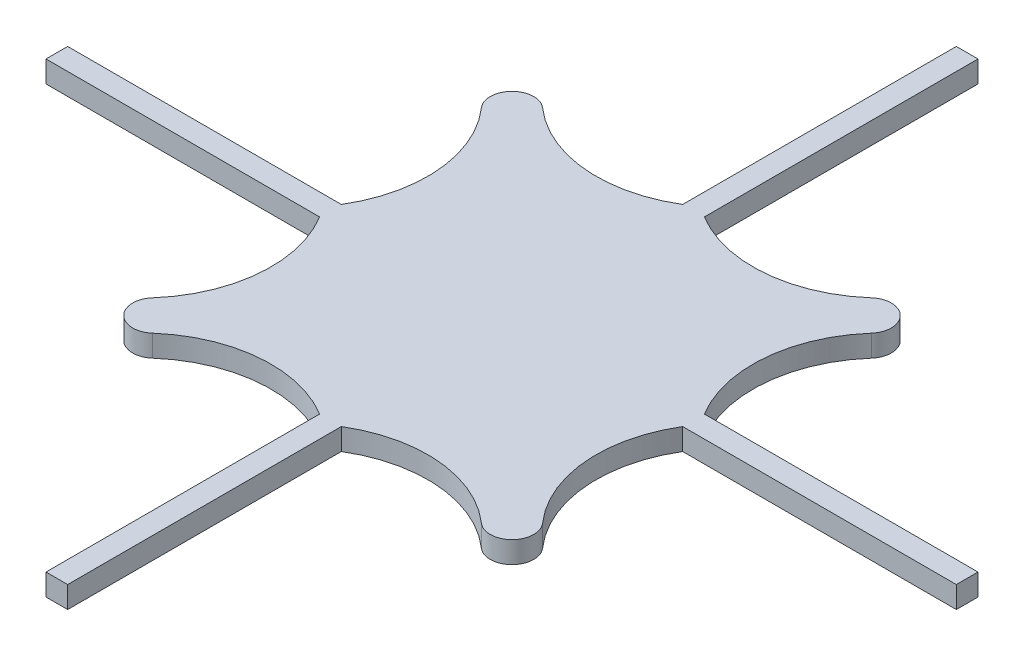
ISO-10303-21;
HEADER;
FILE_DESCRIPTION(('STEP AP214'),'2;1');
FILE_NAME('part.step','',(''),(''),'','','');
FILE_SCHEMA(('AUTOMOTIVE_DESIGN { 1 0 10303 214 1 1 1 1 }'));
ENDSEC;
DATA;
#1=APPLICATION_CONTEXT('core data for automotive mechanical design processes');
#2=APPLICATION_PROTOCOL_DEFINITION('international standard','automotive_design',2000,#1);
#3=PRODUCT_CONTEXT('',#1,'mechanical');
#4=PRODUCT('Part','Part','',(#3));
#5=PRODUCT_RELATED_PRODUCT_CATEGORY('part','',(#4));
#6=PRODUCT_DEFINITION_FORMATION('','',#4);
#7=PRODUCT_DEFINITION_CONTEXT('part definition',#1,'design');
#8=PRODUCT_DEFINITION('design','',#6,#7);
#9=PRODUCT_DEFINITION_SHAPE('','',#8);
#10=(LENGTH_UNIT() NAMED_UNIT(*) SI_UNIT(.MILLI.,.METRE.));
#11=(NAMED_UNIT(*) PLANE_ANGLE_UNIT() SI_UNIT($,.RADIAN.));
#12=(NAMED_UNIT(*) SI_UNIT($,.STERADIAN.) SOLID_ANGLE_UNIT());
#13=UNCERTAINTY_MEASURE_WITH_UNIT(LENGTH_MEASURE(1.E-05),#10,'distance_accuracy_value','');
#14=(GEOMETRIC_REPRESENTATION_CONTEXT(3) GLOBAL_UNCERTAINTY_ASSIGNED_CONTEXT((#13)) GLOBAL_UNIT_ASSIGNED_CONTEXT((#10,
#11,#12)) REPRESENTATION_CONTEXT('',''));
#15=CARTESIAN_POINT('',(0.,0.,0.));
#16=DIRECTION('',(0.,0.,1.));
#17=DIRECTION('',(1.,0.,0.));
#18=AXIS2_PLACEMENT_3D('',#15,#16,#17);
#19=CARTESIAN_POINT('',(-39.76908876951,2.,-14.2537330216353));
#20=DIRECTION('',(0.,-1.,0.));
#21=DIRECTION('',(0.,0.,-1.));
#22=AXIS2_PLACEMENT_3D('',#19,#20,#21);
#23=CYLINDRICAL_SURFACE('',#22,2.);
#24=CARTESIAN_POINT('',(-39.76908876951,0.,-14.2537330216353));
#25=DIRECTION('',(0.,1.,0.));
#26=DIRECTION('',(0.,0.,1.));
#27=AXIS2_PLACEMENT_3D('',#24,#25,#26);
#28=CIRCLE('',#27,2.);
#29=CARTESIAN_POINT('',(-38.4462131139777,0.,-15.7537330216353));
#30=VERTEX_POINT('',#29);
#31=CARTESIAN_POINT('',(-41.26908876951,0.,-12.930857366103));
#32=VERTEX_POINT('',#31);
#33=EDGE_CURVE('E225',#30,#32,#28,.T.);
#34=ORIENTED_EDGE('',*,*,#33,.T.);
#35=DIRECTION('',(0.,-1.,0.));
#36=VECTOR('',#35,1.);
#37=CARTESIAN_POINT('',(-41.26908876951,2.,-12.930857366103));
#38=LINE('',#37,#36);
#39=CARTESIAN_POINT('',(-41.26908876951,2.,-12.930857366103));
#40=VERTEX_POINT('',#39);
#41=EDGE_CURVE('E11',#40,#32,#38,.T.);
#42=ORIENTED_EDGE('',*,*,#41,.F.);
#43=CARTESIAN_POINT('',(-39.76908876951,2.,-14.2537330216353));
#44=DIRECTION('',(0.,1.,0.));
#45=DIRECTION('',(0.,0.,1.));
#46=AXIS2_PLACEMENT_3D('',#43,#44,#45);
#47=CIRCLE('',#46,2.);
#48=CARTESIAN_POINT('',(-38.4462131139777,2.,-15.7537330216353));
#49=VERTEX_POINT('',#48);
#50=EDGE_CURVE('E271',#49,#40,#47,.T.);
#51=ORIENTED_EDGE('',*,*,#50,.F.);
#52=DIRECTION('',(0.,-1.,0.));
#53=VECTOR('',#52,1.);
#54=CARTESIAN_POINT('',(-38.4462131139777,2.,-15.7537330216353));
#55=LINE('',#54,#53);
#56=EDGE_CURVE('E221',#49,#30,#55,.T.);
#57=ORIENTED_EDGE('',*,*,#56,.T.);
#58=EDGE_LOOP('',(#34,#42,#51,#57));
#59=FACE_BOUND('',#58,.T.);
#60=ADVANCED_FACE('F33',(#59),#23,.T.);
#61=CARTESIAN_POINT('',(-50.26908876951,2.,-4.99360343290921));
#62=DIRECTION('',(0.,-1.,0.));
#63=DIRECTION('',(0.,0.,-1.));
#64=AXIS2_PLACEMENT_3D('',#61,#62,#63);
#65=CYLINDRICAL_SURFACE('',#64,12.);
#66=CARTESIAN_POINT('',(-50.26908876951,0.,-4.99360343290921));
#67=DIRECTION('',(0.,-1.,0.));
#68=DIRECTION('',(0.,0.,-1.));
#69=AXIS2_PLACEMENT_3D('',#66,#67,#68);
#70=CIRCLE('',#69,12.);
#71=CARTESIAN_POINT('',(-40.0190147575573,0.,1.24626697836473));
#72=VERTEX_POINT('',#71);
#73=EDGE_CURVE('E228',#32,#72,#70,.T.);
#74=ORIENTED_EDGE('',*,*,#73,.T.);
#75=DIRECTION('',(0.,-1.,0.));
#76=VECTOR('',#75,1.);
#77=CARTESIAN_POINT('',(-40.0190147575573,2.,1.24626697836473));
#78=LINE('',#77,#76);
#79=CARTESIAN_POINT('',(-40.0190147575573,2.,1.24626697836473));
#80=VERTEX_POINT('',#79);
#81=EDGE_CURVE('E41',#80,#72,#78,.T.);
#82=ORIENTED_EDGE('',*,*,#81,.F.);
#83=CARTESIAN_POINT('',(-50.26908876951,2.,-4.99360343290921));
#84=DIRECTION('',(0.,-1.,0.));
#85=DIRECTION('',(0.,0.,-1.));
#86=AXIS2_PLACEMENT_3D('',#83,#84,#85);
#87=CIRCLE('',#86,12.);
#88=EDGE_CURVE('E140',#40,#80,#87,.T.);
#89=ORIENTED_EDGE('',*,*,#88,.F.);
#90=ORIENTED_EDGE('',*,*,#41,.T.);
#91=EDGE_LOOP('',(#74,#82,#89,#90));
#92=FACE_BOUND('',#91,.T.);
#93=ADVANCED_FACE('F409',(#92),#65,.F.);
#94=CARTESIAN_POINT('',(-65.26908876951,2.,1.24626697836478));
#95=DIRECTION('',(0.,0.,1.));
#96=DIRECTION('',(1.,0.,0.));
#97=AXIS2_PLACEMENT_3D('',#94,#95,#96);
#98=PLANE('',#97);
#99=DIRECTION('',(-1.,0.,0.));
#100=VECTOR('',#99,1.);
#101=CARTESIAN_POINT('',(-65.26908876951,0.,1.24626697836478));
#102=LINE('',#101,#100);
#103=CARTESIAN_POINT('',(-65.26908876951,0.,1.24626697836478));
#104=VERTEX_POINT('',#103);
#105=EDGE_CURVE('E230',#72,#104,#102,.T.);
#106=ORIENTED_EDGE('',*,*,#105,.T.);
#107=DIRECTION('',(0.,-1.,0.));
#108=VECTOR('',#107,1.);
#109=CARTESIAN_POINT('',(-65.26908876951,2.,1.24626697836478));
#110=LINE('',#109,#108);
#111=CARTESIAN_POINT('',(-65.26908876951,2.,1.24626697836478));
#112=VERTEX_POINT('',#111);
#113=EDGE_CURVE('E326',#112,#104,#110,.T.);
#114=ORIENTED_EDGE('',*,*,#113,.F.);
#115=DIRECTION('',(-1.,0.,0.));
#116=VECTOR('',#115,1.);
#117=CARTESIAN_POINT('',(-65.26908876951,2.,1.24626697836478));
#118=LINE('',#117,#116);
#119=EDGE_CURVE('E334',#80,#112,#118,.T.);
#120=ORIENTED_EDGE('',*,*,#119,.F.);
#121=ORIENTED_EDGE('',*,*,#81,.T.);
#122=EDGE_LOOP('',(#106,#114,#120,#121));
#123=FACE_BOUND('',#122,.T.);
#124=ADVANCED_FACE('F332',(#123),#98,.F.);
#125=CARTESIAN_POINT('',(-65.26908876951,2.,1.24626697836478));
#126=DIRECTION('',(1.,0.,0.));
#127=DIRECTION('',(0.,0.,-1.));
#128=AXIS2_PLACEMENT_3D('',#125,#126,#127);
#129=PLANE('',#128);
#130=DIRECTION('',(0.,0.,1.));
#131=VECTOR('',#130,1.);
#132=CARTESIAN_POINT('',(-65.26908876951,0.,1.24626697836478));
#133=LINE('',#132,#131);
#134=CARTESIAN_POINT('',(-65.26908876951,0.,3.24626697836463));
#135=VERTEX_POINT('',#134);
#136=EDGE_CURVE('E232',#104,#135,#133,.T.);
#137=ORIENTED_EDGE('',*,*,#136,.T.);
#138=DIRECTION('',(0.,-1.,0.));
#139=VECTOR('',#138,1.);
#140=CARTESIAN_POINT('',(-65.26908876951,2.,3.24626697836463));
#141=LINE('',#140,#139);
#142=CARTESIAN_POINT('',(-65.26908876951,2.,3.24626697836463));
#143=VERTEX_POINT('',#142);
#144=EDGE_CURVE('E323',#143,#135,#141,.T.);
#145=ORIENTED_EDGE('',*,*,#144,.F.);
#146=DIRECTION('',(0.,0.,1.));
#147=VECTOR('',#146,1.);
#148=CARTESIAN_POINT('',(-65.26908876951,2.,1.24626697836478));
#149=LINE('',#148,#147);
#150=EDGE_CURVE('E352',#112,#143,#149,.T.);
#151=ORIENTED_EDGE('',*,*,#150,.F.);
#152=ORIENTED_EDGE('',*,*,#113,.T.);
#153=EDGE_LOOP('',(#137,#145,#151,#152));
#154=FACE_BOUND('',#153,.T.);
#155=ADVANCED_FACE('F343',(#154),#129,.F.);
#156=CARTESIAN_POINT('',(-65.26908876951,2.,3.24626697836463));
#157=DIRECTION('',(0.,0.,-1.));
#158=DIRECTION('',(-1.,0.,0.));
#159=AXIS2_PLACEMENT_3D('',#156,#157,#158);
#160=PLANE('',#159);
#161=DIRECTION('',(1.,0.,0.));
#162=VECTOR('',#161,1.);
#163=CARTESIAN_POINT('',(-65.26908876951,0.,3.24626697836463));
#164=LINE('',#163,#162);
#165=CARTESIAN_POINT('',(-40.0190147575573,0.,3.24626697836468));
#166=VERTEX_POINT('',#165);
#167=EDGE_CURVE('E234',#135,#166,#164,.T.);
#168=ORIENTED_EDGE('',*,*,#167,.T.);
#169=DIRECTION('',(0.,-1.,0.));
#170=VECTOR('',#169,1.);
#171=CARTESIAN_POINT('',(-40.0190147575573,2.,3.24626697836468));
#172=LINE('',#171,#170);
#173=CARTESIAN_POINT('',(-40.0190147575573,2.,3.24626697836468));
#174=VERTEX_POINT('',#173);
#175=EDGE_CURVE('E320',#174,#166,#172,.T.);
#176=ORIENTED_EDGE('',*,*,#175,.F.);
#177=DIRECTION('',(1.,0.,0.));
#178=VECTOR('',#177,1.);
#179=CARTESIAN_POINT('',(-65.26908876951,2.,3.24626697836463));
#180=LINE('',#179,#178);
#181=EDGE_CURVE('E349',#143,#174,#180,.T.);
#182=ORIENTED_EDGE('',*,*,#181,.F.);
#183=ORIENTED_EDGE('',*,*,#144,.T.);
#184=EDGE_LOOP('',(#168,#176,#182,#183));
#185=FACE_BOUND('',#184,.T.);
#186=ADVANCED_FACE('F347',(#185),#160,.F.);
#187=CARTESIAN_POINT('',(-50.26908876951,2.,9.48613738963862));
#188=DIRECTION('',(0.,-1.,0.));
#189=DIRECTION('',(0.,0.,-1.));
#190=AXIS2_PLACEMENT_3D('',#187,#188,#189);
#191=CYLINDRICAL_SURFACE('',#190,12.);
#192=CARTESIAN_POINT('',(-50.26908876951,0.,9.48613738963862));
#193=DIRECTION('',(0.,-1.,0.));
#194=DIRECTION('',(0.,0.,1.));
#195=AXIS2_PLACEMENT_3D('',#192,#193,#194);
#196=CIRCLE('',#195,12.);
#197=CARTESIAN_POINT('',(-41.26908876951,0.,17.4233913228324));
#198=VERTEX_POINT('',#197);
#199=EDGE_CURVE('E236',#166,#198,#196,.T.);
#200=ORIENTED_EDGE('',*,*,#199,.T.);
#201=DIRECTION('',(0.,-1.,0.));
#202=VECTOR('',#201,1.);
#203=CARTESIAN_POINT('',(-41.26908876951,2.,17.4233913228324));
#204=LINE('',#203,#202);
#205=CARTESIAN_POINT('',(-41.26908876951,2.,17.4233913228324));
#206=VERTEX_POINT('',#205);
#207=EDGE_CURVE('E317',#206,#198,#204,.T.);
#208=ORIENTED_EDGE('',*,*,#207,.F.);
#209=CARTESIAN_POINT('',(-50.26908876951,2.,9.48613738963862));
#210=DIRECTION('',(0.,-1.,0.));
#211=DIRECTION('',(0.,0.,1.));
#212=AXIS2_PLACEMENT_3D('',#209,#210,#211);
#213=CIRCLE('',#212,12.);
#214=EDGE_CURVE('E351',#174,#206,#213,.T.);
#215=ORIENTED_EDGE('',*,*,#214,.F.);
#216=ORIENTED_EDGE('',*,*,#175,.T.);
#217=EDGE_LOOP('',(#200,#208,#215,#216));
#218=FACE_BOUND('',#217,.T.);
#219=ADVANCED_FACE('F422',(#218),#191,.F.);
#220=CARTESIAN_POINT('',(-39.76908876951,2.,18.7462669783647));
#221=DIRECTION('',(0.,-1.,0.));
#222=DIRECTION('',(0.,0.,-1.));
#223=AXIS2_PLACEMENT_3D('',#220,#221,#222);
#224=CYLINDRICAL_SURFACE('',#223,2.);
#225=CARTESIAN_POINT('',(-39.76908876951,0.,18.7462669783647));
#226=DIRECTION('',(0.,1.,0.));
#227=DIRECTION('',(0.,0.,-1.));
#228=AXIS2_PLACEMENT_3D('',#225,#226,#227);
#229=CIRCLE('',#228,2.);
#230=CARTESIAN_POINT('',(-38.4462131139777,0.,20.2462669783647));
#231=VERTEX_POINT('',#230);
#232=EDGE_CURVE('E238',#198,#231,#229,.T.);
#233=ORIENTED_EDGE('',*,*,#232,.T.);
#234=DIRECTION('',(0.,-1.,0.));
#235=VECTOR('',#234,1.);
#236=CARTESIAN_POINT('',(-38.4462131139777,2.,20.2462669783647));
#237=LINE('',#236,#235);
#238=CARTESIAN_POINT('',(-38.4462131139777,2.,20.2462669783647));
#239=VERTEX_POINT('',#238);
#240=EDGE_CURVE('E314',#239,#231,#237,.T.);
#241=ORIENTED_EDGE('',*,*,#240,.F.);
#242=CARTESIAN_POINT('',(-39.76908876951,2.,18.7462669783647));
#243=DIRECTION('',(0.,1.,0.));
#244=DIRECTION('',(0.,0.,-1.));
#245=AXIS2_PLACEMENT_3D('',#242,#243,#244);
#246=CIRCLE('',#245,2.);
#247=EDGE_CURVE('E354',#206,#239,#246,.T.);
#248=ORIENTED_EDGE('',*,*,#247,.F.);
#249=ORIENTED_EDGE('',*,*,#207,.T.);
#250=EDGE_LOOP('',(#233,#241,#248,#249));
#251=FACE_BOUND('',#250,.T.);
#252=ADVANCED_FACE('F425',(#251),#224,.T.);
#253=CARTESIAN_POINT('',(-30.5089591807839,2.,29.2462669783647));
#254=DIRECTION('',(0.,-1.,0.));
#255=DIRECTION('',(0.,0.,-1.));
#256=AXIS2_PLACEMENT_3D('',#253,#254,#255);
#257=CYLINDRICAL_SURFACE('',#256,12.);
#258=CARTESIAN_POINT('',(-30.5089591807839,0.,29.2462669783647));
#259=DIRECTION('',(0.,-1.,0.));
#260=DIRECTION('',(0.,0.,-1.));
#261=AXIS2_PLACEMENT_3D('',#258,#259,#260);
#262=CIRCLE('',#261,12.);
#263=CARTESIAN_POINT('',(-24.26908876951,0.,18.996192966412));
#264=VERTEX_POINT('',#263);
#265=EDGE_CURVE('E240',#231,#264,#262,.T.);
#266=ORIENTED_EDGE('',*,*,#265,.T.);
#267=DIRECTION('',(0.,-1.,0.));
#268=VECTOR('',#267,1.);
#269=CARTESIAN_POINT('',(-24.26908876951,2.,18.996192966412));
#270=LINE('',#269,#268);
#271=CARTESIAN_POINT('',(-24.26908876951,2.,18.996192966412));
#272=VERTEX_POINT('',#271);
#273=EDGE_CURVE('E311',#272,#264,#270,.T.);
#274=ORIENTED_EDGE('',*,*,#273,.F.);
#275=CARTESIAN_POINT('',(-30.5089591807839,2.,29.2462669783647));
#276=DIRECTION('',(0.,-1.,0.));
#277=DIRECTION('',(0.,0.,-1.));
#278=AXIS2_PLACEMENT_3D('',#275,#276,#277);
#279=CIRCLE('',#278,12.);
#280=EDGE_CURVE('E360',#239,#272,#279,.T.);
#281=ORIENTED_EDGE('',*,*,#280,.F.);
#282=ORIENTED_EDGE('',*,*,#240,.T.);
#283=EDGE_LOOP('',(#266,#274,#281,#282));
#284=FACE_BOUND('',#283,.T.);
#285=ADVANCED_FACE('F429',(#284),#257,.F.);
#286=CARTESIAN_POINT('',(-24.26908876951,2.,44.2462669783647));
#287=DIRECTION('',(1.,0.,0.));
#288=DIRECTION('',(0.,0.,-1.));
#289=AXIS2_PLACEMENT_3D('',#286,#287,#288);
#290=PLANE('',#289);
#291=DIRECTION('',(0.,0.,1.));
#292=VECTOR('',#291,1.);
#293=CARTESIAN_POINT('',(-24.26908876951,0.,44.2462669783647));
#294=LINE('',#293,#292);
#295=CARTESIAN_POINT('',(-24.26908876951,0.,44.2462669783647));
#296=VERTEX_POINT('',#295);
#297=EDGE_CURVE('E242',#264,#296,#294,.T.);
#298=ORIENTED_EDGE('',*,*,#297,.T.);
#299=DIRECTION('',(0.,-1.,0.));
#300=VECTOR('',#299,1.);
#301=CARTESIAN_POINT('',(-24.26908876951,2.,44.2462669783647));
#302=LINE('',#301,#300);
#303=CARTESIAN_POINT('',(-24.26908876951,2.,44.2462669783647));
#304=VERTEX_POINT('',#303);
#305=EDGE_CURVE('E308',#304,#296,#302,.T.);
#306=ORIENTED_EDGE('',*,*,#305,.F.);
#307=DIRECTION('',(0.,0.,1.));
#308=VECTOR('',#307,1.);
#309=CARTESIAN_POINT('',(-24.26908876951,2.,44.2462669783647));
#310=LINE('',#309,#308);
#311=EDGE_CURVE('E362',#272,#304,#310,.T.);
#312=ORIENTED_EDGE('',*,*,#311,.F.);
#313=ORIENTED_EDGE('',*,*,#273,.T.);
#314=EDGE_LOOP('',(#298,#306,#312,#313));
#315=FACE_BOUND('',#314,.T.);
#316=ADVANCED_FACE('F433',(#315),#290,.F.);
#317=CARTESIAN_POINT('',(-24.26908876951,2.,44.2462669783647));
#318=DIRECTION('',(0.,0.,-1.));
#319=DIRECTION('',(-1.,0.,0.));
#320=AXIS2_PLACEMENT_3D('',#317,#318,#319);
#321=PLANE('',#320);
#322=DIRECTION('',(1.,0.,0.));
#323=VECTOR('',#322,1.);
#324=CARTESIAN_POINT('',(-24.26908876951,0.,44.2462669783647));
#325=LINE('',#324,#323);
#326=CARTESIAN_POINT('',(-22.26908876951,0.,44.2462669783647));
#327=VERTEX_POINT('',#326);
#328=EDGE_CURVE('E244',#296,#327,#325,.T.);
#329=ORIENTED_EDGE('',*,*,#328,.T.);
#330=DIRECTION('',(0.,-1.,0.));
#331=VECTOR('',#330,1.);
#332=CARTESIAN_POINT('',(-22.26908876951,2.,44.2462669783647));
#333=LINE('',#332,#331);
#334=CARTESIAN_POINT('',(-22.26908876951,2.,44.2462669783647));
#335=VERTEX_POINT('',#334);
#336=EDGE_CURVE('E305',#335,#327,#333,.T.);
#337=ORIENTED_EDGE('',*,*,#336,.F.);
#338=DIRECTION('',(1.,0.,0.));
#339=VECTOR('',#338,1.);
#340=CARTESIAN_POINT('',(-24.26908876951,2.,44.2462669783647));
#341=LINE('',#340,#339);
#342=EDGE_CURVE('E364',#304,#335,#341,.T.);
#343=ORIENTED_EDGE('',*,*,#342,.F.);
#344=ORIENTED_EDGE('',*,*,#305,.T.);
#345=EDGE_LOOP('',(#329,#337,#343,#344));
#346=FACE_BOUND('',#345,.T.);
#347=ADVANCED_FACE('F437',(#346),#321,.F.);
#348=CARTESIAN_POINT('',(-22.26908876951,2.,44.2462669783647));
#349=DIRECTION('',(-1.,0.,0.));
#350=DIRECTION('',(0.,0.,1.));
#351=AXIS2_PLACEMENT_3D('',#348,#349,#350);
#352=PLANE('',#351);
#353=DIRECTION('',(0.,0.,-1.));
#354=VECTOR('',#353,1.);
#355=CARTESIAN_POINT('',(-22.26908876951,0.,44.2462669783647));
#356=LINE('',#355,#354);
#357=CARTESIAN_POINT('',(-22.26908876951,0.,18.996192966412));
#358=VERTEX_POINT('',#357);
#359=EDGE_CURVE('E246',#327,#358,#356,.T.);
#360=ORIENTED_EDGE('',*,*,#359,.T.);
#361=DIRECTION('',(0.,-1.,0.));
#362=VECTOR('',#361,1.);
#363=CARTESIAN_POINT('',(-22.26908876951,2.,18.996192966412));
#364=LINE('',#363,#362);
#365=CARTESIAN_POINT('',(-22.26908876951,2.,18.996192966412));
#366=VERTEX_POINT('',#365);
#367=EDGE_CURVE('E302',#366,#358,#364,.T.);
#368=ORIENTED_EDGE('',*,*,#367,.F.);
#369=DIRECTION('',(0.,0.,-1.));
#370=VECTOR('',#369,1.);
#371=CARTESIAN_POINT('',(-22.26908876951,2.,44.2462669783647));
#372=LINE('',#371,#370);
#373=EDGE_CURVE('E366',#335,#366,#372,.T.);
#374=ORIENTED_EDGE('',*,*,#373,.F.);
#375=ORIENTED_EDGE('',*,*,#336,.T.);
#376=EDGE_LOOP('',(#360,#368,#374,#375));
#377=FACE_BOUND('',#376,.T.);
#378=ADVANCED_FACE('F441',(#377),#352,.F.);
#379=CARTESIAN_POINT('',(-16.029218358236,2.,29.2462669783647));
#380=DIRECTION('',(0.,-1.,0.));
#381=DIRECTION('',(0.,0.,-1.));
#382=AXIS2_PLACEMENT_3D('',#379,#380,#381);
#383=CYLINDRICAL_SURFACE('',#382,12.);
#384=CARTESIAN_POINT('',(-16.029218358236,0.,29.2462669783647));
#385=DIRECTION('',(0.,-1.,0.));
#386=DIRECTION('',(0.,0.,1.));
#387=AXIS2_PLACEMENT_3D('',#384,#385,#386);
#388=CIRCLE('',#387,12.);
#389=CARTESIAN_POINT('',(-8.09196442504223,0.,20.2462669783647));
#390=VERTEX_POINT('',#389);
#391=EDGE_CURVE('E248',#358,#390,#388,.T.);
#392=ORIENTED_EDGE('',*,*,#391,.T.);
#393=DIRECTION('',(0.,-1.,0.));
#394=VECTOR('',#393,1.);
#395=CARTESIAN_POINT('',(-8.09196442504223,2.,20.2462669783647));
#396=LINE('',#395,#394);
#397=CARTESIAN_POINT('',(-8.09196442504223,2.,20.2462669783647));
#398=VERTEX_POINT('',#397);
#399=EDGE_CURVE('E299',#398,#390,#396,.T.);
#400=ORIENTED_EDGE('',*,*,#399,.F.);
#401=CARTESIAN_POINT('',(-16.029218358236,2.,29.2462669783647));
#402=DIRECTION('',(0.,-1.,0.));
#403=DIRECTION('',(0.,0.,1.));
#404=AXIS2_PLACEMENT_3D('',#401,#402,#403);
#405=CIRCLE('',#404,12.);
#406=EDGE_CURVE('E368',#366,#398,#405,.T.);
#407=ORIENTED_EDGE('',*,*,#406,.F.);
#408=ORIENTED_EDGE('',*,*,#367,.T.);
#409=EDGE_LOOP('',(#392,#400,#407,#408));
#410=FACE_BOUND('',#409,.T.);
#411=ADVANCED_FACE('F445',(#410),#383,.F.);
#412=CARTESIAN_POINT('',(-6.76908876950993,2.,18.7462669783647));
#413=DIRECTION('',(0.,-1.,0.));
#414=DIRECTION('',(0.,0.,-1.));
#415=AXIS2_PLACEMENT_3D('',#412,#413,#414);
#416=CYLINDRICAL_SURFACE('',#415,2.);
#417=CARTESIAN_POINT('',(-6.76908876950993,0.,18.7462669783647));
#418=DIRECTION('',(0.,1.,0.));
#419=DIRECTION('',(0.,0.,1.));
#420=AXIS2_PLACEMENT_3D('',#417,#418,#419);
#421=CIRCLE('',#420,2.);
#422=CARTESIAN_POINT('',(-5.26908876950994,0.,17.4233913228324));
#423=VERTEX_POINT('',#422);
#424=EDGE_CURVE('E250',#390,#423,#421,.T.);
#425=ORIENTED_EDGE('',*,*,#424,.T.);
#426=DIRECTION('',(0.,-1.,0.));
#427=VECTOR('',#426,1.);
#428=CARTESIAN_POINT('',(-5.26908876950994,2.,17.4233913228324));
#429=LINE('',#428,#427);
#430=CARTESIAN_POINT('',(-5.26908876950994,2.,17.4233913228324));
#431=VERTEX_POINT('',#430);
#432=EDGE_CURVE('E296',#431,#423,#429,.T.);
#433=ORIENTED_EDGE('',*,*,#432,.F.);
#434=CARTESIAN_POINT('',(-6.76908876950993,2.,18.7462669783647));
#435=DIRECTION('',(0.,1.,0.));
#436=DIRECTION('',(0.,0.,1.));
#437=AXIS2_PLACEMENT_3D('',#434,#435,#436);
#438=CIRCLE('',#437,2.);
#439=EDGE_CURVE('E370',#398,#431,#438,.T.);
#440=ORIENTED_EDGE('',*,*,#439,.F.);
#441=ORIENTED_EDGE('',*,*,#399,.T.);
#442=EDGE_LOOP('',(#425,#433,#440,#441));
#443=FACE_BOUND('',#442,.T.);
#444=ADVANCED_FACE('F449',(#443),#416,.T.);
#445=CARTESIAN_POINT('',(3.73091123049005,2.,9.48613738963862));
#446=DIRECTION('',(0.,-1.,0.));
#447=DIRECTION('',(0.,0.,-1.));
#448=AXIS2_PLACEMENT_3D('',#445,#446,#447);
#449=CYLINDRICAL_SURFACE('',#448,12.);
#450=CARTESIAN_POINT('',(3.73091123049005,0.,9.48613738963862));
#451=DIRECTION('',(0.,-1.,0.));
#452=DIRECTION('',(0.,0.,-1.));
#453=AXIS2_PLACEMENT_3D('',#450,#451,#452);
#454=CIRCLE('',#453,12.);
#455=CARTESIAN_POINT('',(-6.51916278146264,0.,3.24626697836468));
#456=VERTEX_POINT('',#455);
#457=EDGE_CURVE('E252',#423,#456,#454,.T.);
#458=ORIENTED_EDGE('',*,*,#457,.T.);
#459=DIRECTION('',(0.,-1.,0.));
#460=VECTOR('',#459,1.);
#461=CARTESIAN_POINT('',(-6.51916278146264,2.,3.24626697836468));
#462=LINE('',#461,#460);
#463=CARTESIAN_POINT('',(-6.51916278146264,2.,3.24626697836468));
#464=VERTEX_POINT('',#463);
#465=EDGE_CURVE('E293',#464,#456,#462,.T.);
#466=ORIENTED_EDGE('',*,*,#465,.F.);
#467=CARTESIAN_POINT('',(3.73091123049005,2.,9.48613738963862));
#468=DIRECTION('',(0.,-1.,0.));
#469=DIRECTION('',(0.,0.,-1.));
#470=AXIS2_PLACEMENT_3D('',#467,#468,#469);
#471=CIRCLE('',#470,12.);
#472=EDGE_CURVE('E372',#431,#464,#471,.T.);
#473=ORIENTED_EDGE('',*,*,#472,.F.);
#474=ORIENTED_EDGE('',*,*,#432,.T.);
#475=EDGE_LOOP('',(#458,#466,#473,#474));
#476=FACE_BOUND('',#475,.T.);
#477=ADVANCED_FACE('F453',(#476),#449,.F.);
#478=CARTESIAN_POINT('',(18.73091123049,2.,3.24626697836463));
#479=DIRECTION('',(0.,0.,-1.));
#480=DIRECTION('',(-1.,0.,0.));
#481=AXIS2_PLACEMENT_3D('',#478,#479,#480);
#482=PLANE('',#481);
#483=DIRECTION('',(1.,0.,0.));
#484=VECTOR('',#483,1.);
#485=CARTESIAN_POINT('',(18.73091123049,0.,3.24626697836463));
#486=LINE('',#485,#484);
#487=CARTESIAN_POINT('',(18.73091123049,0.,3.24626697836463));
#488=VERTEX_POINT('',#487);
#489=EDGE_CURVE('E254',#456,#488,#486,.T.);
#490=ORIENTED_EDGE('',*,*,#489,.T.);
#491=DIRECTION('',(0.,-1.,0.));
#492=VECTOR('',#491,1.);
#493=CARTESIAN_POINT('',(18.73091123049,2.,3.24626697836463));
#494=LINE('',#493,#492);
#495=CARTESIAN_POINT('',(18.73091123049,2.,3.24626697836463));
#496=VERTEX_POINT('',#495);
#497=EDGE_CURVE('E290',#496,#488,#494,.T.);
#498=ORIENTED_EDGE('',*,*,#497,.F.);
#499=DIRECTION('',(1.,0.,0.));
#500=VECTOR('',#499,1.);
#501=CARTESIAN_POINT('',(18.73091123049,2.,3.24626697836463));
#502=LINE('',#501,#500);
#503=EDGE_CURVE('E374',#464,#496,#502,.T.);
#504=ORIENTED_EDGE('',*,*,#503,.F.);
#505=ORIENTED_EDGE('',*,*,#465,.T.);
#506=EDGE_LOOP('',(#490,#498,#504,#505));
#507=FACE_BOUND('',#506,.T.);
#508=ADVANCED_FACE('F457',(#507),#482,.F.);
#509=CARTESIAN_POINT('',(18.73091123049,2.,1.24626697836478));
#510=DIRECTION('',(-1.,0.,0.));
#511=DIRECTION('',(0.,0.,1.));
#512=AXIS2_PLACEMENT_3D('',#509,#510,#511);
#513=PLANE('',#512);
#514=DIRECTION('',(0.,0.,-1.));
#515=VECTOR('',#514,1.);
#516=CARTESIAN_POINT('',(18.73091123049,0.,1.24626697836478));
#517=LINE('',#516,#515);
#518=CARTESIAN_POINT('',(18.73091123049,0.,1.24626697836478));
#519=VERTEX_POINT('',#518);
#520=EDGE_CURVE('E256',#488,#519,#517,.T.);
#521=ORIENTED_EDGE('',*,*,#520,.T.);
#522=DIRECTION('',(0.,-1.,0.));
#523=VECTOR('',#522,1.);
#524=CARTESIAN_POINT('',(18.73091123049,2.,1.24626697836478));
#525=LINE('',#524,#523);
#526=CARTESIAN_POINT('',(18.73091123049,2.,1.24626697836478));
#527=VERTEX_POINT('',#526);
#528=EDGE_CURVE('E287',#527,#519,#525,.T.);
#529=ORIENTED_EDGE('',*,*,#528,.F.);
#530=DIRECTION('',(0.,0.,-1.));
#531=VECTOR('',#530,1.);
#532=CARTESIAN_POINT('',(18.73091123049,2.,1.24626697836478));
#533=LINE('',#532,#531);
#534=EDGE_CURVE('E376',#496,#527,#533,.T.);
#535=ORIENTED_EDGE('',*,*,#534,.F.);
#536=ORIENTED_EDGE('',*,*,#497,.T.);
#537=EDGE_LOOP('',(#521,#529,#535,#536));
#538=FACE_BOUND('',#537,.T.);
#539=ADVANCED_FACE('F461',(#538),#513,.F.);
#540=CARTESIAN_POINT('',(18.73091123049,2.,1.24626697836478));
#541=DIRECTION('',(0.,0.,1.));
#542=DIRECTION('',(1.,0.,0.));
#543=AXIS2_PLACEMENT_3D('',#540,#541,#542);
#544=PLANE('',#543);
#545=DIRECTION('',(-1.,0.,0.));
#546=VECTOR('',#545,1.);
#547=CARTESIAN_POINT('',(18.73091123049,0.,1.24626697836478));
#548=LINE('',#547,#546);
#549=CARTESIAN_POINT('',(-6.51916278146264,0.,1.24626697836473));
#550=VERTEX_POINT('',#549);
#551=EDGE_CURVE('E258',#519,#550,#548,.T.);
#552=ORIENTED_EDGE('',*,*,#551,.T.);
#553=DIRECTION('',(0.,-1.,0.));
#554=VECTOR('',#553,1.);
#555=CARTESIAN_POINT('',(-6.51916278146264,2.,1.24626697836473));
#556=LINE('',#555,#554);
#557=CARTESIAN_POINT('',(-6.51916278146264,2.,1.24626697836473));
#558=VERTEX_POINT('',#557);
#559=EDGE_CURVE('E284',#558,#550,#556,.T.);
#560=ORIENTED_EDGE('',*,*,#559,.F.);
#561=DIRECTION('',(-1.,0.,0.));
#562=VECTOR('',#561,1.);
#563=CARTESIAN_POINT('',(18.73091123049,2.,1.24626697836478));
#564=LINE('',#563,#562);
#565=EDGE_CURVE('E378',#527,#558,#564,.T.);
#566=ORIENTED_EDGE('',*,*,#565,.F.);
#567=ORIENTED_EDGE('',*,*,#528,.T.);
#568=EDGE_LOOP('',(#552,#560,#566,#567));
#569=FACE_BOUND('',#568,.T.);
#570=ADVANCED_FACE('F465',(#569),#544,.F.);
#571=CARTESIAN_POINT('',(3.73091123049005,2.,-4.99360343290921));
#572=DIRECTION('',(0.,-1.,0.));
#573=DIRECTION('',(0.,0.,-1.));
#574=AXIS2_PLACEMENT_3D('',#571,#572,#573);
#575=CYLINDRICAL_SURFACE('',#574,12.);
#576=CARTESIAN_POINT('',(3.73091123049005,0.,-4.99360343290921));
#577=DIRECTION('',(0.,-1.,0.));
#578=DIRECTION('',(0.,0.,1.));
#579=AXIS2_PLACEMENT_3D('',#576,#577,#578);
#580=CIRCLE('',#579,12.);
#581=CARTESIAN_POINT('',(-5.26908876950994,0.,-12.930857366103));
#582=VERTEX_POINT('',#581);
#583=EDGE_CURVE('E260',#550,#582,#580,.T.);
#584=ORIENTED_EDGE('',*,*,#583,.T.);
#585=DIRECTION('',(0.,-1.,0.));
#586=VECTOR('',#585,1.);
#587=CARTESIAN_POINT('',(-5.26908876950994,2.,-12.930857366103));
#588=LINE('',#587,#586);
#589=CARTESIAN_POINT('',(-5.26908876950994,2.,-12.930857366103));
#590=VERTEX_POINT('',#589);
#591=EDGE_CURVE('E281',#590,#582,#588,.T.);
#592=ORIENTED_EDGE('',*,*,#591,.F.);
#593=CARTESIAN_POINT('',(3.73091123049005,2.,-4.99360343290921));
#594=DIRECTION('',(0.,-1.,0.));
#595=DIRECTION('',(0.,0.,1.));
#596=AXIS2_PLACEMENT_3D('',#593,#594,#595);
#597=CIRCLE('',#596,12.);
#598=EDGE_CURVE('E380',#558,#590,#597,.T.);
#599=ORIENTED_EDGE('',*,*,#598,.F.);
#600=ORIENTED_EDGE('',*,*,#559,.T.);
#601=EDGE_LOOP('',(#584,#592,#599,#600));
#602=FACE_BOUND('',#601,.T.);
#603=ADVANCED_FACE('F469',(#602),#575,.F.);
#604=CARTESIAN_POINT('',(-6.76908876950993,2.,-14.2537330216353));
#605=DIRECTION('',(0.,-1.,0.));
#606=DIRECTION('',(0.,0.,-1.));
#607=AXIS2_PLACEMENT_3D('',#604,#605,#606);
#608=CYLINDRICAL_SURFACE('',#607,2.);
#609=CARTESIAN_POINT('',(-6.76908876950993,0.,-14.2537330216353));
#610=DIRECTION('',(0.,1.,0.));
#611=DIRECTION('',(0.,0.,-1.));
#612=AXIS2_PLACEMENT_3D('',#609,#610,#611);
#613=CIRCLE('',#612,2.);
#614=CARTESIAN_POINT('',(-8.09196442504223,0.,-15.7537330216353));
#615=VERTEX_POINT('',#614);
#616=EDGE_CURVE('E262',#582,#615,#613,.T.);
#617=ORIENTED_EDGE('',*,*,#616,.T.);
#618=DIRECTION('',(0.,-1.,0.));
#619=VECTOR('',#618,1.);
#620=CARTESIAN_POINT('',(-8.09196442504223,2.,-15.7537330216353));
#621=LINE('',#620,#619);
#622=CARTESIAN_POINT('',(-8.09196442504223,2.,-15.7537330216353));
#623=VERTEX_POINT('',#622);
#624=EDGE_CURVE('E278',#623,#615,#621,.T.);
#625=ORIENTED_EDGE('',*,*,#624,.F.);
#626=CARTESIAN_POINT('',(-6.76908876950993,2.,-14.2537330216353));
#627=DIRECTION('',(0.,1.,0.));
#628=DIRECTION('',(0.,0.,-1.));
#629=AXIS2_PLACEMENT_3D('',#626,#627,#628);
#630=CIRCLE('',#629,2.);
#631=EDGE_CURVE('E382',#590,#623,#630,.T.);
#632=ORIENTED_EDGE('',*,*,#631,.F.);
#633=ORIENTED_EDGE('',*,*,#591,.T.);
#634=EDGE_LOOP('',(#617,#625,#632,#633));
#635=FACE_BOUND('',#634,.T.);
#636=ADVANCED_FACE('F473',(#635),#608,.T.);
#637=CARTESIAN_POINT('',(-16.029218358236,2.,-24.7537330216353));
#638=DIRECTION('',(0.,-1.,0.));
#639=DIRECTION('',(0.,0.,-1.));
#640=AXIS2_PLACEMENT_3D('',#637,#638,#639);
#641=CYLINDRICAL_SURFACE('',#640,12.);
#642=CARTESIAN_POINT('',(-16.029218358236,0.,-24.7537330216353));
#643=DIRECTION('',(0.,-1.,0.));
#644=DIRECTION('',(0.,0.,-1.));
#645=AXIS2_PLACEMENT_3D('',#642,#643,#644);
#646=CIRCLE('',#645,12.);
#647=CARTESIAN_POINT('',(-22.26908876951,0.,-14.5036590096826));
#648=VERTEX_POINT('',#647);
#649=EDGE_CURVE('E264',#615,#648,#646,.T.);
#650=ORIENTED_EDGE('',*,*,#649,.T.);
#651=DIRECTION('',(0.,-1.,0.));
#652=VECTOR('',#651,1.);
#653=CARTESIAN_POINT('',(-22.26908876951,2.,-14.5036590096826));
#654=LINE('',#653,#652);
#655=CARTESIAN_POINT('',(-22.26908876951,2.,-14.5036590096826));
#656=VERTEX_POINT('',#655);
#657=EDGE_CURVE('E275',#656,#648,#654,.T.);
#658=ORIENTED_EDGE('',*,*,#657,.F.);
#659=CARTESIAN_POINT('',(-16.029218358236,2.,-24.7537330216353));
#660=DIRECTION('',(0.,-1.,0.));
#661=DIRECTION('',(0.,0.,-1.));
#662=AXIS2_PLACEMENT_3D('',#659,#660,#661);
#663=CIRCLE('',#662,12.);
#664=EDGE_CURVE('E384',#623,#656,#663,.T.);
#665=ORIENTED_EDGE('',*,*,#664,.F.);
#666=ORIENTED_EDGE('',*,*,#624,.T.);
#667=EDGE_LOOP('',(#650,#658,#665,#666));
#668=FACE_BOUND('',#667,.T.);
#669=ADVANCED_FACE('F390',(#668),#641,.F.);
#670=CARTESIAN_POINT('',(-22.26908876951,2.,-39.7537330216353));
#671=DIRECTION('',(-1.,0.,0.));
#672=DIRECTION('',(0.,0.,1.));
#673=AXIS2_PLACEMENT_3D('',#670,#671,#672);
#674=PLANE('',#673);
#675=DIRECTION('',(0.,0.,-1.));
#676=VECTOR('',#675,1.);
#677=CARTESIAN_POINT('',(-22.26908876951,0.,-39.7537330216353));
#678=LINE('',#677,#676);
#679=CARTESIAN_POINT('',(-22.26908876951,0.,-39.7537330216353));
#680=VERTEX_POINT('',#679);
#681=EDGE_CURVE('E266',#648,#680,#678,.T.);
#682=ORIENTED_EDGE('',*,*,#681,.T.);
#683=DIRECTION('',(0.,-1.,0.));
#684=VECTOR('',#683,1.);
#685=CARTESIAN_POINT('',(-22.26908876951,2.,-39.7537330216353));
#686=LINE('',#685,#684);
#687=CARTESIAN_POINT('',(-22.26908876951,2.,-39.7537330216353));
#688=VERTEX_POINT('',#687);
#689=EDGE_CURVE('E216',#688,#680,#686,.T.);
#690=ORIENTED_EDGE('',*,*,#689,.F.);
#691=DIRECTION('',(0.,0.,-1.));
#692=VECTOR('',#691,1.);
#693=CARTESIAN_POINT('',(-22.26908876951,2.,-39.7537330216353));
#694=LINE('',#693,#692);
#695=EDGE_CURVE('E207',#656,#688,#694,.T.);
#696=ORIENTED_EDGE('',*,*,#695,.F.);
#697=ORIENTED_EDGE('',*,*,#657,.T.);
#698=EDGE_LOOP('',(#682,#690,#696,#697));
#699=FACE_BOUND('',#698,.T.);
#700=ADVANCED_FACE('F394',(#699),#674,.F.);
#701=CARTESIAN_POINT('',(-24.26908876951,2.,-39.7537330216353));
#702=DIRECTION('',(0.,0.,1.));
#703=DIRECTION('',(1.,0.,0.));
#704=AXIS2_PLACEMENT_3D('',#701,#702,#703);
#705=PLANE('',#704);
#706=DIRECTION('',(-1.,0.,0.));
#707=VECTOR('',#706,1.);
#708=CARTESIAN_POINT('',(-24.26908876951,0.,-39.7537330216353));
#709=LINE('',#708,#707);
#710=CARTESIAN_POINT('',(-24.26908876951,0.,-39.7537330216353));
#711=VERTEX_POINT('',#710);
#712=EDGE_CURVE('E215',#680,#711,#709,.T.);
#713=ORIENTED_EDGE('',*,*,#712,.T.);
#714=DIRECTION('',(0.,-1.,0.));
#715=VECTOR('',#714,1.);
#716=CARTESIAN_POINT('',(-24.26908876951,2.,-39.7537330216353));
#717=LINE('',#716,#715);
#718=CARTESIAN_POINT('',(-24.26908876951,2.,-39.7537330216353));
#719=VERTEX_POINT('',#718);
#720=EDGE_CURVE('E212',#719,#711,#717,.T.);
#721=ORIENTED_EDGE('',*,*,#720,.F.);
#722=DIRECTION('',(-1.,0.,0.));
#723=VECTOR('',#722,1.);
#724=CARTESIAN_POINT('',(-24.26908876951,2.,-39.7537330216353));
#725=LINE('',#724,#723);
#726=EDGE_CURVE('E201',#688,#719,#725,.T.);
#727=ORIENTED_EDGE('',*,*,#726,.F.);
#728=ORIENTED_EDGE('',*,*,#689,.T.);
#729=EDGE_LOOP('',(#713,#721,#727,#728));
#730=FACE_BOUND('',#729,.T.);
#731=ADVANCED_FACE('F213',(#730),#705,.F.);
#732=CARTESIAN_POINT('',(-24.26908876951,2.,-39.7537330216353));
#733=DIRECTION('',(1.,0.,0.));
#734=DIRECTION('',(0.,0.,-1.));
#735=AXIS2_PLACEMENT_3D('',#732,#733,#734);
#736=PLANE('',#735);
#737=DIRECTION('',(0.,0.,1.));
#738=VECTOR('',#737,1.);
#739=CARTESIAN_POINT('',(-24.26908876951,0.,-39.7537330216353));
#740=LINE('',#739,#738);
#741=CARTESIAN_POINT('',(-24.26908876951,0.,-14.5036590096826));
#742=VERTEX_POINT('',#741);
#743=EDGE_CURVE('E126',#711,#742,#740,.T.);
#744=ORIENTED_EDGE('',*,*,#743,.T.);
#745=DIRECTION('',(0.,-1.,0.));
#746=VECTOR('',#745,1.);
#747=CARTESIAN_POINT('',(-24.26908876951,2.,-14.5036590096826));
#748=LINE('',#747,#746);
#749=CARTESIAN_POINT('',(-24.26908876951,2.,-14.5036590096826));
#750=VERTEX_POINT('',#749);
#751=EDGE_CURVE('E217',#750,#742,#748,.T.);
#752=ORIENTED_EDGE('',*,*,#751,.F.);
#753=DIRECTION('',(0.,0.,1.));
#754=VECTOR('',#753,1.);
#755=CARTESIAN_POINT('',(-24.26908876951,2.,-39.7537330216353));
#756=LINE('',#755,#754);
#757=EDGE_CURVE('E205',#719,#750,#756,.T.);
#758=ORIENTED_EDGE('',*,*,#757,.F.);
#759=ORIENTED_EDGE('',*,*,#720,.T.);
#760=EDGE_LOOP('',(#744,#752,#758,#759));
#761=FACE_BOUND('',#760,.T.);
#762=ADVANCED_FACE('F219',(#761),#736,.F.);
#763=CARTESIAN_POINT('',(-30.5089591807839,2.,-24.7537330216353));
#764=DIRECTION('',(0.,-1.,0.));
#765=DIRECTION('',(0.,0.,-1.));
#766=AXIS2_PLACEMENT_3D('',#763,#764,#765);
#767=CYLINDRICAL_SURFACE('',#766,12.);
#768=CARTESIAN_POINT('',(-30.5089591807839,0.,-24.7537330216353));
#769=DIRECTION('',(0.,-1.,0.));
#770=DIRECTION('',(0.,0.,1.));
#771=AXIS2_PLACEMENT_3D('',#768,#769,#770);
#772=CIRCLE('',#771,12.);
#773=EDGE_CURVE('E132',#742,#30,#772,.T.);
#774=ORIENTED_EDGE('',*,*,#773,.T.);
#775=ORIENTED_EDGE('',*,*,#56,.F.);
#776=CARTESIAN_POINT('',(-30.5089591807839,2.,-24.7537330216353));
#777=DIRECTION('',(0.,-1.,0.));
#778=DIRECTION('',(0.,0.,1.));
#779=AXIS2_PLACEMENT_3D('',#776,#777,#778);
#780=CIRCLE('',#779,12.);
#781=EDGE_CURVE('E49',#750,#49,#780,.T.);
#782=ORIENTED_EDGE('',*,*,#781,.F.);
#783=ORIENTED_EDGE('',*,*,#751,.T.);
#784=EDGE_LOOP('',(#774,#775,#782,#783));
#785=FACE_BOUND('',#784,.T.);
#786=ADVANCED_FACE('F398',(#785),#767,.F.);
#787=CARTESIAN_POINT('',(-39.76908876951,2.,-14.2537330216353));
#788=DIRECTION('',(0.,1.,0.));
#789=DIRECTION('',(0.,0.,1.));
#790=AXIS2_PLACEMENT_3D('',#787,#788,#789);
#791=PLANE('',#790);
#792=ORIENTED_EDGE('',*,*,#50,.T.);
#793=ORIENTED_EDGE('',*,*,#88,.T.);
#794=ORIENTED_EDGE('',*,*,#119,.T.);
#795=ORIENTED_EDGE('',*,*,#150,.T.);
#796=ORIENTED_EDGE('',*,*,#181,.T.);
#797=ORIENTED_EDGE('',*,*,#214,.T.);
#798=ORIENTED_EDGE('',*,*,#247,.T.);
#799=ORIENTED_EDGE('',*,*,#280,.T.);
#800=ORIENTED_EDGE('',*,*,#311,.T.);
#801=ORIENTED_EDGE('',*,*,#342,.T.);
#802=ORIENTED_EDGE('',*,*,#373,.T.);
#803=ORIENTED_EDGE('',*,*,#406,.T.);
#804=ORIENTED_EDGE('',*,*,#439,.T.);
#805=ORIENTED_EDGE('',*,*,#472,.T.);
#806=ORIENTED_EDGE('',*,*,#503,.T.);
#807=ORIENTED_EDGE('',*,*,#534,.T.);
#808=ORIENTED_EDGE('',*,*,#565,.T.);
#809=ORIENTED_EDGE('',*,*,#598,.T.);
#810=ORIENTED_EDGE('',*,*,#631,.T.);
#811=ORIENTED_EDGE('',*,*,#664,.T.);
#812=ORIENTED_EDGE('',*,*,#695,.T.);
#813=ORIENTED_EDGE('',*,*,#726,.T.);
#814=ORIENTED_EDGE('',*,*,#757,.T.);
#815=ORIENTED_EDGE('',*,*,#781,.T.);
#816=EDGE_LOOP('',(#792,#793,#794,#795,#796,#797,#798,#799,#800,#801,#802,#803,#804,#805,#806,
#807,#808,#809,#810,#811,#812,#813,#814,#815));
#817=FACE_BOUND('',#816,.T.);
#818=ADVANCED_FACE('F203',(#817),#791,.T.);
#819=CARTESIAN_POINT('',(-39.76908876951,0.,-14.2537330216353));
#820=DIRECTION('',(0.,1.,0.));
#821=DIRECTION('',(0.,0.,1.));
#822=AXIS2_PLACEMENT_3D('',#819,#820,#821);
#823=PLANE('',#822);
#824=ORIENTED_EDGE('',*,*,#33,.F.);
#825=ORIENTED_EDGE('',*,*,#773,.F.);
#826=ORIENTED_EDGE('',*,*,#743,.F.);
#827=ORIENTED_EDGE('',*,*,#712,.F.);
#828=ORIENTED_EDGE('',*,*,#681,.F.);
#829=ORIENTED_EDGE('',*,*,#649,.F.);
#830=ORIENTED_EDGE('',*,*,#616,.F.);
#831=ORIENTED_EDGE('',*,*,#583,.F.);
#832=ORIENTED_EDGE('',*,*,#551,.F.);
#833=ORIENTED_EDGE('',*,*,#520,.F.);
#834=ORIENTED_EDGE('',*,*,#489,.F.);
#835=ORIENTED_EDGE('',*,*,#457,.F.);
#836=ORIENTED_EDGE('',*,*,#424,.F.);
#837=ORIENTED_EDGE('',*,*,#391,.F.);
#838=ORIENTED_EDGE('',*,*,#359,.F.);
#839=ORIENTED_EDGE('',*,*,#328,.F.);
#840=ORIENTED_EDGE('',*,*,#297,.F.);
#841=ORIENTED_EDGE('',*,*,#265,.F.);
#842=ORIENTED_EDGE('',*,*,#232,.F.);
#843=ORIENTED_EDGE('',*,*,#199,.F.);
#844=ORIENTED_EDGE('',*,*,#167,.F.);
#845=ORIENTED_EDGE('',*,*,#136,.F.);
#846=ORIENTED_EDGE('',*,*,#105,.F.);
#847=ORIENTED_EDGE('',*,*,#73,.F.);
#848=EDGE_LOOP('',(#824,#825,#826,#827,#828,#829,#830,#831,#832,#833,#834,#835,#836,#837,#838,
#839,#840,#841,#842,#843,#844,#845,#846,#847));
#849=FACE_BOUND('',#848,.T.);
#850=ADVANCED_FACE('F338',(#849),#823,.F.);
#851=CLOSED_SHELL('',(#60,#93,#124,#155,#186,#219,#252,#285,#316,#347,#378,#411,#444,#477,#508,
#539,#570,#603,#636,#669,#700,#731,#762,#786,#818,#850));
#852=MANIFOLD_SOLID_BREP('B2',#851);
#853=ADVANCED_BREP_SHAPE_REPRESENTATION('',(#18,#852),#14);
#854=SHAPE_DEFINITION_REPRESENTATION(#9,#853);
ENDSEC;
END-ISO-10303-21;
